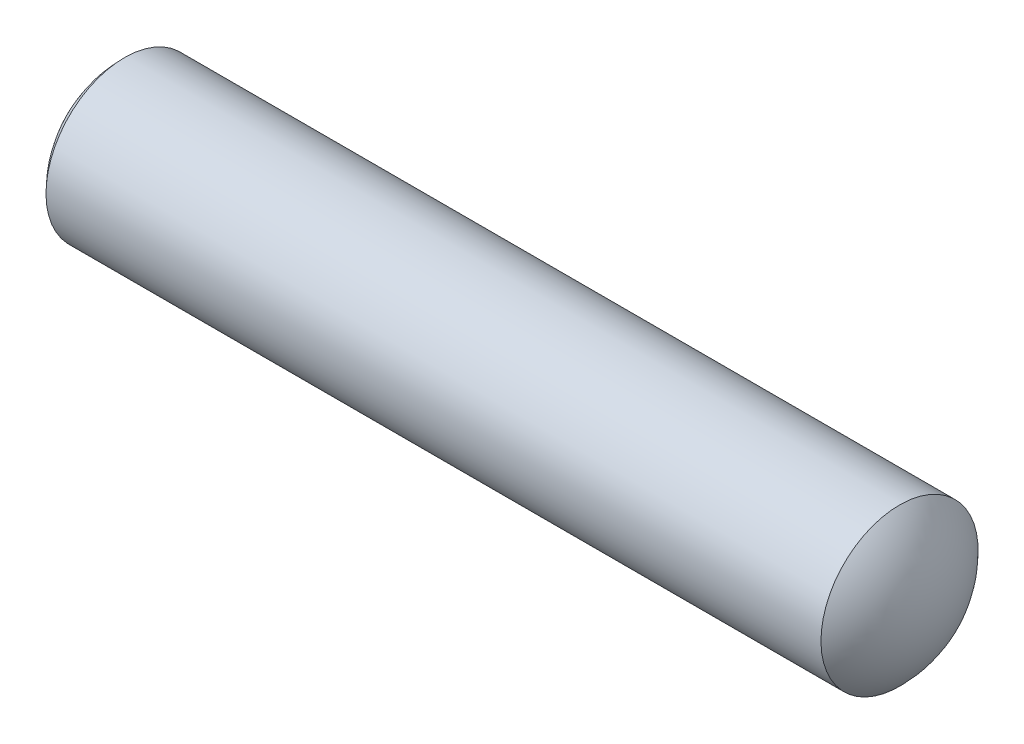
ISO-10303-21;
HEADER;
FILE_DESCRIPTION(('STEP AP214'),'2;1');
FILE_NAME('part.step','',(''),(''),'','','');
FILE_SCHEMA(('AUTOMOTIVE_DESIGN { 1 0 10303 214 1 1 1 1 }'));
ENDSEC;
DATA;
#1=APPLICATION_CONTEXT('core data for automotive mechanical design processes');
#2=APPLICATION_PROTOCOL_DEFINITION('international standard','automotive_design',2000,#1);
#3=PRODUCT_CONTEXT('',#1,'mechanical');
#4=PRODUCT('Part','Part','',(#3));
#5=PRODUCT_RELATED_PRODUCT_CATEGORY('part','',(#4));
#6=PRODUCT_DEFINITION_FORMATION('','',#4);
#7=PRODUCT_DEFINITION_CONTEXT('part definition',#1,'design');
#8=PRODUCT_DEFINITION('design','',#6,#7);
#9=PRODUCT_DEFINITION_SHAPE('','',#8);
#10=(LENGTH_UNIT() NAMED_UNIT(*) SI_UNIT(.MILLI.,.METRE.));
#11=(NAMED_UNIT(*) PLANE_ANGLE_UNIT() SI_UNIT($,.RADIAN.));
#12=(NAMED_UNIT(*) SI_UNIT($,.STERADIAN.) SOLID_ANGLE_UNIT());
#13=UNCERTAINTY_MEASURE_WITH_UNIT(LENGTH_MEASURE(1.E-05),#10,'distance_accuracy_value','');
#14=(GEOMETRIC_REPRESENTATION_CONTEXT(3) GLOBAL_UNCERTAINTY_ASSIGNED_CONTEXT((#13)) GLOBAL_UNIT_ASSIGNED_CONTEXT((#10,
#11,#12)) REPRESENTATION_CONTEXT('',''));
#15=CARTESIAN_POINT('',(0.,0.,0.));
#16=DIRECTION('',(0.,0.,1.));
#17=DIRECTION('',(1.,0.,0.));
#18=AXIS2_PLACEMENT_3D('',#15,#16,#17);
#19=CARTESIAN_POINT('',(15.1875,17.9292159184646,-11.5224074220224));
#20=DIRECTION('',(0.,0.540640817455597,0.841253532831182));
#21=DIRECTION('',(1.,0.,0.));
#22=AXIS2_PLACEMENT_3D('',#19,#20,#21);
#23=SPHERICAL_SURFACE('',#22,1.8375);
#24=CARTESIAN_POINT('',(15.1875,17.9292159184646,-11.5224074220224));
#25=DIRECTION('',(-1.,0.,0.));
#26=DIRECTION('',(0.,-0.841253532831181,0.540640817455598));
#27=AXIS2_PLACEMENT_3D('',#24,#25,#26);
#28=SPHERICAL_SURFACE('',#27,1.8375);
#29=CARTESIAN_POINT('',(16.4734821149612,17.9292159184646,-11.5224074220224));
#30=DIRECTION('',(-1.,0.,0.));
#31=DIRECTION('',(0.,-0.841253532831181,0.540640817455598));
#32=AXIS2_PLACEMENT_3D('',#29,#30,#31);
#33=CIRCLE('',#32,1.3125);
#34=CARTESIAN_POINT('',(16.4734821149612,16.8250706566237,-10.8128163491119));
#35=VERTEX_POINT('',#34);
#36=EDGE_CURVE('E11',#35,#35,#33,.T.);
#37=ORIENTED_EDGE('',*,*,#36,.F.);
#38=EDGE_LOOP('',(#37));
#39=FACE_BOUND('',#38,.T.);
#40=ADVANCED_FACE('F17',(#39),#28,.T.);
#41=CARTESIAN_POINT('',(10.,17.9292159184645,-11.5224074220224));
#42=DIRECTION('',(-1.,0.,0.));
#43=DIRECTION('',(0.,-0.841253532831181,0.540640817455598));
#44=AXIS2_PLACEMENT_3D('',#41,#42,#43);
#45=CYLINDRICAL_SURFACE('',#44,1.3125);
#46=CARTESIAN_POINT('',(3.52651788503884,17.9292159184645,-11.5224074220224));
#47=DIRECTION('',(-1.,0.,0.));
#48=DIRECTION('',(0.,-0.841253532831181,0.540640817455598));
#49=AXIS2_PLACEMENT_3D('',#46,#47,#48);
#50=CIRCLE('',#49,1.3125);
#51=CARTESIAN_POINT('',(3.52651788503884,16.8250706566236,-10.8128163491119));
#52=VERTEX_POINT('',#51);
#53=EDGE_CURVE('E26',#52,#52,#50,.T.);
#54=ORIENTED_EDGE('',*,*,#53,.F.);
#55=EDGE_LOOP('',(#54));
#56=FACE_BOUND('',#55,.T.);
#57=ORIENTED_EDGE('',*,*,#36,.T.);
#58=EDGE_LOOP('',(#57));
#59=FACE_BOUND('',#58,.T.);
#60=ADVANCED_FACE('F47',(#56,#59),#45,.T.);
#61=CARTESIAN_POINT('',(4.8125,17.9292159184645,-11.5224074220224));
#62=DIRECTION('',(0.,0.540640817455597,0.841253532831182));
#63=DIRECTION('',(-1.,0.,0.));
#64=AXIS2_PLACEMENT_3D('',#61,#62,#63);
#65=SPHERICAL_SURFACE('',#64,1.8375);
#66=CARTESIAN_POINT('',(4.8125,17.9292159184645,-11.5224074220224));
#67=DIRECTION('',(-1.,0.,0.));
#68=DIRECTION('',(0.,-0.841253532831181,0.540640817455598));
#69=AXIS2_PLACEMENT_3D('',#66,#67,#68);
#70=SPHERICAL_SURFACE('',#69,1.8375);
#71=ORIENTED_EDGE('',*,*,#53,.T.);
#72=EDGE_LOOP('',(#71));
#73=FACE_BOUND('',#72,.T.);
#74=ADVANCED_FACE('F19',(#73),#70,.T.);
#75=CLOSED_SHELL('',(#40,#60,#74));
#76=MANIFOLD_SOLID_BREP('B1',#75);
#77=ADVANCED_BREP_SHAPE_REPRESENTATION('',(#18,#76),#14);
#78=SHAPE_DEFINITION_REPRESENTATION(#9,#77);
ENDSEC;
END-ISO-10303-21;
